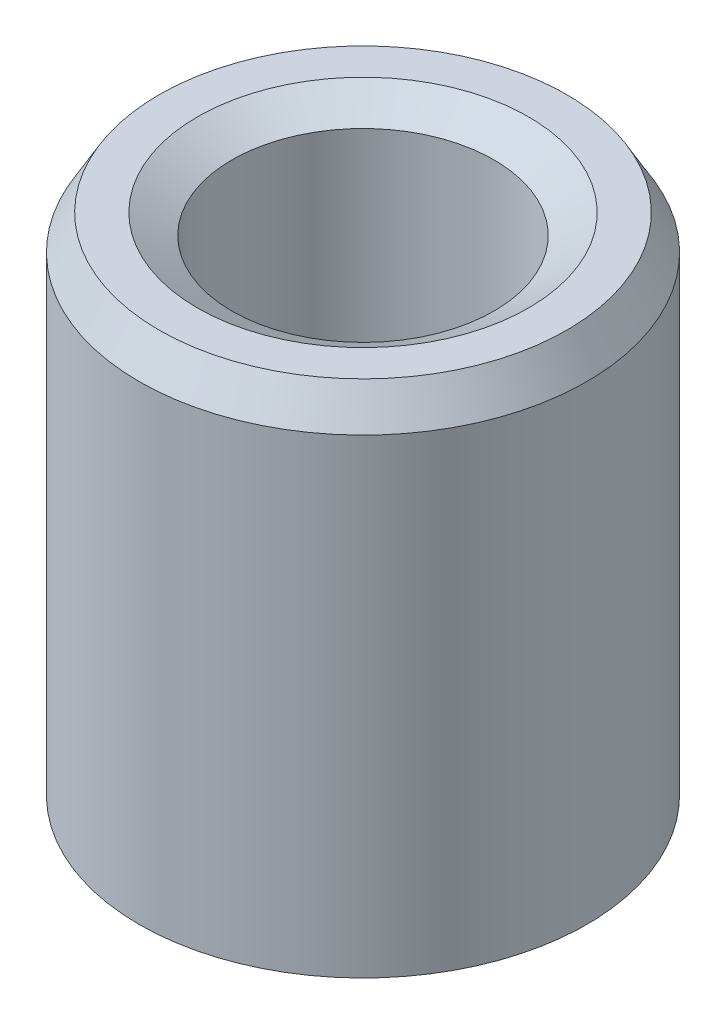
ISO-10303-21;
HEADER;
FILE_DESCRIPTION(('STEP AP214'),'2;1');
FILE_NAME('part.step','',(''),(''),'','','');
FILE_SCHEMA(('AUTOMOTIVE_DESIGN { 1 0 10303 214 1 1 1 1 }'));
ENDSEC;
DATA;
#1=APPLICATION_CONTEXT('core data for automotive mechanical design processes');
#2=APPLICATION_PROTOCOL_DEFINITION('international standard','automotive_design',2000,#1);
#3=PRODUCT_CONTEXT('',#1,'mechanical');
#4=PRODUCT('Part','Part','',(#3));
#5=PRODUCT_RELATED_PRODUCT_CATEGORY('part','',(#4));
#6=PRODUCT_DEFINITION_FORMATION('','',#4);
#7=PRODUCT_DEFINITION_CONTEXT('part definition',#1,'design');
#8=PRODUCT_DEFINITION('design','',#6,#7);
#9=PRODUCT_DEFINITION_SHAPE('','',#8);
#10=(LENGTH_UNIT() NAMED_UNIT(*) SI_UNIT(.MILLI.,.METRE.));
#11=(NAMED_UNIT(*) PLANE_ANGLE_UNIT() SI_UNIT($,.RADIAN.));
#12=(NAMED_UNIT(*) SI_UNIT($,.STERADIAN.) SOLID_ANGLE_UNIT());
#13=UNCERTAINTY_MEASURE_WITH_UNIT(LENGTH_MEASURE(1.E-05),#10,'distance_accuracy_value','');
#14=(GEOMETRIC_REPRESENTATION_CONTEXT(3) GLOBAL_UNCERTAINTY_ASSIGNED_CONTEXT((#13)) GLOBAL_UNIT_ASSIGNED_CONTEXT((#10,
#11,#12)) REPRESENTATION_CONTEXT('',''));
#15=CARTESIAN_POINT('',(0.,0.,0.));
#16=DIRECTION('',(0.,0.,1.));
#17=DIRECTION('',(1.,0.,0.));
#18=AXIS2_PLACEMENT_3D('',#15,#16,#17);
#19=CARTESIAN_POINT('',(0.,35.1589705973085,0.));
#20=DIRECTION('',(0.,-1.,0.));
#21=DIRECTION('',(0.,0.,-1.));
#22=AXIS2_PLACEMENT_3D('',#19,#20,#21);
#23=CYLINDRICAL_SURFACE('',#22,15.);
#24=CARTESIAN_POINT('',(0.,1.33754541449681,0.));
#25=DIRECTION('',(0.,1.,0.));
#26=DIRECTION('',(0.,0.,1.));
#27=AXIS2_PLACEMENT_3D('',#24,#25,#26);
#28=CIRCLE('',#27,15.);
#29=CARTESIAN_POINT('',(0.,1.33754541449681,15.));
#30=VERTEX_POINT('',#29);
#31=EDGE_CURVE('E10',#30,#30,#28,.T.);
#32=ORIENTED_EDGE('',*,*,#31,.T.);
#33=EDGE_LOOP('',(#32));
#34=FACE_BOUND('',#33,.T.);
#35=CARTESIAN_POINT('',(0.,32.8422739819692,0.));
#36=DIRECTION('',(0.,1.,0.));
#37=DIRECTION('',(0.,0.,1.));
#38=AXIS2_PLACEMENT_3D('',#35,#36,#37);
#39=CIRCLE('',#38,15.);
#40=CARTESIAN_POINT('',(0.,32.8422739819692,15.));
#41=VERTEX_POINT('',#40);
#42=EDGE_CURVE('E50',#41,#41,#39,.F.);
#43=ORIENTED_EDGE('',*,*,#42,.T.);
#44=EDGE_LOOP('',(#43));
#45=FACE_BOUND('',#44,.T.);
#46=ADVANCED_FACE('F39',(#34,#45),#23,.T.);
#47=CARTESIAN_POINT('',(0.,35.1589705973085,0.));
#48=DIRECTION('',(0.,1.,0.));
#49=DIRECTION('',(0.,0.,1.));
#50=AXIS2_PLACEMENT_3D('',#47,#48,#49);
#51=PLANE('',#50);
#52=CARTESIAN_POINT('',(0.,35.1589705973085,0.));
#53=DIRECTION('',(0.,1.,0.));
#54=DIRECTION('',(0.,0.,1.));
#55=AXIS2_PLACEMENT_3D('',#52,#53,#54);
#56=CIRCLE('',#55,11.0958713185807);
#57=CARTESIAN_POINT('',(0.,35.1589705973085,11.0958713185807));
#58=VERTEX_POINT('',#57);
#59=EDGE_CURVE('E58',#58,#58,#56,.F.);
#60=ORIENTED_EDGE('',*,*,#59,.T.);
#61=EDGE_LOOP('',(#60));
#62=FACE_BOUND('',#61,.T.);
#63=CARTESIAN_POINT('',(0.,35.1589705973085,0.));
#64=DIRECTION('',(0.,1.,0.));
#65=DIRECTION('',(0.,0.,1.));
#66=AXIS2_PLACEMENT_3D('',#63,#64,#65);
#67=CIRCLE('',#66,13.6624545855032);
#68=CARTESIAN_POINT('',(0.,35.1589705973085,13.6624545855032));
#69=VERTEX_POINT('',#68);
#70=EDGE_CURVE('E61',#69,#69,#67,.T.);
#71=ORIENTED_EDGE('',*,*,#70,.T.);
#72=EDGE_LOOP('',(#71));
#73=FACE_BOUND('',#72,.T.);
#74=ADVANCED_FACE('F88',(#62,#73),#51,.T.);
#75=CARTESIAN_POINT('',(0.,0.,0.));
#76=DIRECTION('',(0.,1.,0.));
#77=DIRECTION('',(0.,0.,1.));
#78=AXIS2_PLACEMENT_3D('',#75,#76,#77);
#79=PLANE('',#78);
#80=CARTESIAN_POINT('',(0.,0.,0.));
#81=DIRECTION('',(0.,1.,0.));
#82=DIRECTION('',(0.,0.,1.));
#83=AXIS2_PLACEMENT_3D('',#80,#81,#82);
#84=CIRCLE('',#83,10.1167201177382);
#85=CARTESIAN_POINT('',(0.,0.,10.1167201177382));
#86=VERTEX_POINT('',#85);
#87=EDGE_CURVE('E51',#86,#86,#84,.T.);
#88=ORIENTED_EDGE('',*,*,#87,.T.);
#89=EDGE_LOOP('',(#88));
#90=FACE_BOUND('',#89,.T.);
#91=CARTESIAN_POINT('',(0.,0.,0.));
#92=DIRECTION('',(0.,1.,0.));
#93=DIRECTION('',(0.,0.,1.));
#94=AXIS2_PLACEMENT_3D('',#91,#92,#93);
#95=CIRCLE('',#94,12.6833033846607);
#96=CARTESIAN_POINT('',(0.,0.,12.6833033846607));
#97=VERTEX_POINT('',#96);
#98=EDGE_CURVE('E54',#97,#97,#95,.F.);
#99=ORIENTED_EDGE('',*,*,#98,.T.);
#100=EDGE_LOOP('',(#99));
#101=FACE_BOUND('',#100,.T.);
#102=ADVANCED_FACE('F83',(#90,#101),#79,.F.);
#103=CARTESIAN_POINT('',(0.,35.1589705973085,0.));
#104=DIRECTION('',(0.,-1.,0.));
#105=DIRECTION('',(0.,0.,-1.));
#106=AXIS2_PLACEMENT_3D('',#103,#104,#105);
#107=CYLINDRICAL_SURFACE('',#106,8.77917470324138);
#108=CARTESIAN_POINT('',(0.,33.8214251828117,0.));
#109=DIRECTION('',(0.,1.,0.));
#110=DIRECTION('',(0.,0.,1.));
#111=AXIS2_PLACEMENT_3D('',#108,#109,#110);
#112=CIRCLE('',#111,8.77917470324138);
#113=CARTESIAN_POINT('',(0.,33.8214251828117,8.77917470324138));
#114=VERTEX_POINT('',#113);
#115=EDGE_CURVE('E67',#114,#114,#112,.T.);
#116=ORIENTED_EDGE('',*,*,#115,.T.);
#117=EDGE_LOOP('',(#116));
#118=FACE_BOUND('',#117,.T.);
#119=CARTESIAN_POINT('',(0.,2.31669661533927,0.));
#120=DIRECTION('',(0.,1.,0.));
#121=DIRECTION('',(0.,0.,1.));
#122=AXIS2_PLACEMENT_3D('',#119,#120,#121);
#123=CIRCLE('',#122,8.77917470324138);
#124=CARTESIAN_POINT('',(0.,2.31669661533927,8.77917470324138));
#125=VERTEX_POINT('',#124);
#126=EDGE_CURVE('E69',#125,#125,#123,.F.);
#127=ORIENTED_EDGE('',*,*,#126,.T.);
#128=EDGE_LOOP('',(#127));
#129=FACE_BOUND('',#128,.T.);
#130=ADVANCED_FACE('F71',(#118,#129),#107,.F.);
#131=CARTESIAN_POINT('',(0.,33.8214251828117,0.));
#132=DIRECTION('',(0.,1.,0.));
#133=DIRECTION('',(0.,0.,1.));
#134=AXIS2_PLACEMENT_3D('',#131,#132,#133);
#135=CONICAL_SURFACE('',#134,8.77917470324138,1.0471975511966);
#136=ORIENTED_EDGE('',*,*,#59,.F.);
#137=EDGE_LOOP('',(#136));
#138=FACE_BOUND('',#137,.T.);
#139=ORIENTED_EDGE('',*,*,#115,.F.);
#140=EDGE_LOOP('',(#139));
#141=FACE_BOUND('',#140,.T.);
#142=ADVANCED_FACE('F77',(#138,#141),#135,.F.);
#143=CARTESIAN_POINT('',(0.,0.,0.));
#144=DIRECTION('',(0.,-1.,0.));
#145=DIRECTION('',(0.,0.,-1.));
#146=AXIS2_PLACEMENT_3D('',#143,#144,#145);
#147=CONICAL_SURFACE('',#146,10.1167201177382,0.523598775598295);
#148=ORIENTED_EDGE('',*,*,#126,.F.);
#149=EDGE_LOOP('',(#148));
#150=FACE_BOUND('',#149,.T.);
#151=ORIENTED_EDGE('',*,*,#87,.F.);
#152=EDGE_LOOP('',(#151));
#153=FACE_BOUND('',#152,.T.);
#154=ADVANCED_FACE('F73',(#150,#153),#147,.F.);
#155=CARTESIAN_POINT('',(0.,1.33754541449681,0.));
#156=DIRECTION('',(0.,1.,0.));
#157=DIRECTION('',(0.,0.,1.));
#158=AXIS2_PLACEMENT_3D('',#155,#156,#157);
#159=CONICAL_SURFACE('',#158,15.,1.0471975511966);
#160=ORIENTED_EDGE('',*,*,#98,.F.);
#161=EDGE_LOOP('',(#160));
#162=FACE_BOUND('',#161,.T.);
#163=ORIENTED_EDGE('',*,*,#31,.F.);
#164=EDGE_LOOP('',(#163));
#165=FACE_BOUND('',#164,.T.);
#166=ADVANCED_FACE('F76',(#162,#165),#159,.T.);
#167=CARTESIAN_POINT('',(0.,35.1589705973085,0.));
#168=DIRECTION('',(0.,-1.,0.));
#169=DIRECTION('',(0.,0.,-1.));
#170=AXIS2_PLACEMENT_3D('',#167,#168,#169);
#171=CONICAL_SURFACE('',#170,13.6624545855032,0.523598775598294);
#172=ORIENTED_EDGE('',*,*,#42,.F.);
#173=EDGE_LOOP('',(#172));
#174=FACE_BOUND('',#173,.T.);
#175=ORIENTED_EDGE('',*,*,#70,.F.);
#176=EDGE_LOOP('',(#175));
#177=FACE_BOUND('',#176,.T.);
#178=ADVANCED_FACE('F45',(#174,#177),#171,.T.);
#179=CLOSED_SHELL('',(#46,#74,#102,#130,#142,#154,#166,#178));
#180=MANIFOLD_SOLID_BREP('B2',#179);
#181=ADVANCED_BREP_SHAPE_REPRESENTATION('',(#18,#180),#14);
#182=SHAPE_DEFINITION_REPRESENTATION(#9,#181);
ENDSEC;
END-ISO-10303-21;
